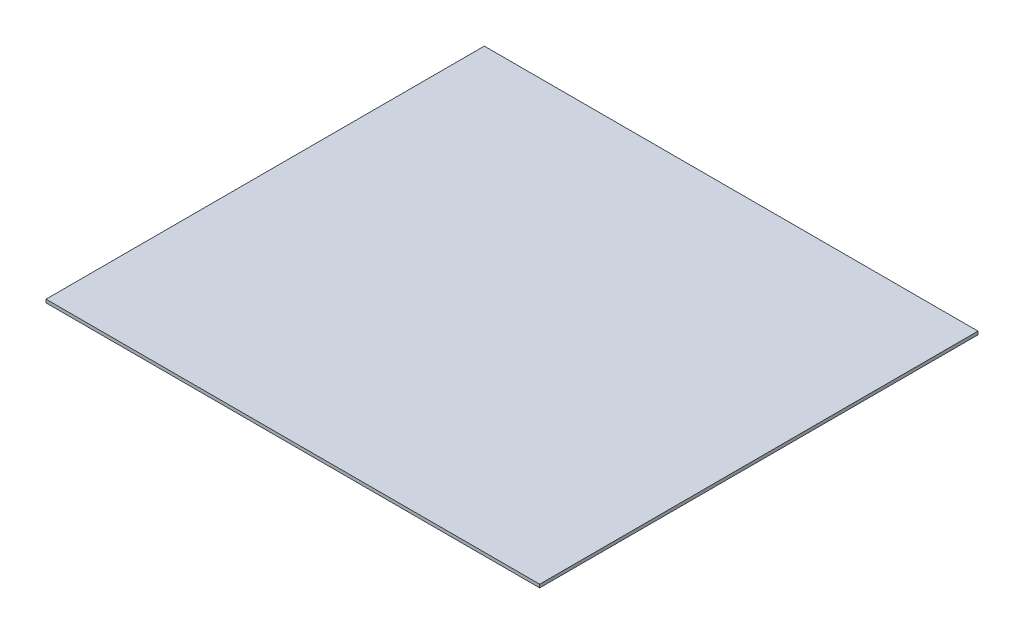
ISO-10303-21;
HEADER;
FILE_DESCRIPTION(('STEP AP214'),'2;1');
FILE_NAME('part.step','',(''),(''),'','','');
FILE_SCHEMA(('AUTOMOTIVE_DESIGN { 1 0 10303 214 1 1 1 1 }'));
ENDSEC;
DATA;
#1=APPLICATION_CONTEXT('core data for automotive mechanical design processes');
#2=APPLICATION_PROTOCOL_DEFINITION('international standard','automotive_design',2000,#1);
#3=PRODUCT_CONTEXT('',#1,'mechanical');
#4=PRODUCT('Part','Part','',(#3));
#5=PRODUCT_RELATED_PRODUCT_CATEGORY('part','',(#4));
#6=PRODUCT_DEFINITION_FORMATION('','',#4);
#7=PRODUCT_DEFINITION_CONTEXT('part definition',#1,'design');
#8=PRODUCT_DEFINITION('design','',#6,#7);
#9=PRODUCT_DEFINITION_SHAPE('','',#8);
#10=(LENGTH_UNIT() NAMED_UNIT(*) SI_UNIT(.MILLI.,.METRE.));
#11=(NAMED_UNIT(*) PLANE_ANGLE_UNIT() SI_UNIT($,.RADIAN.));
#12=(NAMED_UNIT(*) SI_UNIT($,.STERADIAN.) SOLID_ANGLE_UNIT());
#13=UNCERTAINTY_MEASURE_WITH_UNIT(LENGTH_MEASURE(1.E-05),#10,'distance_accuracy_value','');
#14=(GEOMETRIC_REPRESENTATION_CONTEXT(3) GLOBAL_UNCERTAINTY_ASSIGNED_CONTEXT((#13)) GLOBAL_UNIT_ASSIGNED_CONTEXT((#10,
#11,#12)) REPRESENTATION_CONTEXT('',''));
#15=CARTESIAN_POINT('',(0.,0.,0.));
#16=DIRECTION('',(0.,0.,1.));
#17=DIRECTION('',(1.,0.,0.));
#18=AXIS2_PLACEMENT_3D('',#15,#16,#17);
#19=CARTESIAN_POINT('',(-230.884572681199,0.,-410.));
#20=DIRECTION('',(-1.,0.,0.));
#21=DIRECTION('',(0.,-1.,0.));
#22=AXIS2_PLACEMENT_3D('',#19,#20,#21);
#23=PLANE('',#22);
#24=DIRECTION('',(0.,-1.,0.));
#25=VECTOR('',#24,1.);
#26=CARTESIAN_POINT('',(-230.884572681199,0.,0.));
#27=LINE('',#26,#25);
#28=CARTESIAN_POINT('',(-230.884572681199,3.,0.));
#29=VERTEX_POINT('',#28);
#30=CARTESIAN_POINT('',(-230.884572681199,0.,0.));
#31=VERTEX_POINT('',#30);
#32=EDGE_CURVE('E99',#29,#31,#27,.T.);
#33=ORIENTED_EDGE('',*,*,#32,.F.);
#34=DIRECTION('',(0.,0.,1.));
#35=VECTOR('',#34,1.);
#36=CARTESIAN_POINT('',(-230.884572681199,3.,-410.));
#37=LINE('',#36,#35);
#38=CARTESIAN_POINT('',(-230.884572681199,3.,-410.));
#39=VERTEX_POINT('',#38);
#40=EDGE_CURVE('E11',#39,#29,#37,.T.);
#41=ORIENTED_EDGE('',*,*,#40,.F.);
#42=DIRECTION('',(0.,-1.,0.));
#43=VECTOR('',#42,1.);
#44=CARTESIAN_POINT('',(-230.884572681199,0.,-410.));
#45=LINE('',#44,#43);
#46=CARTESIAN_POINT('',(-230.884572681199,0.,-410.));
#47=VERTEX_POINT('',#46);
#48=EDGE_CURVE('E93',#39,#47,#45,.T.);
#49=ORIENTED_EDGE('',*,*,#48,.T.);
#50=DIRECTION('',(0.,0.,1.));
#51=VECTOR('',#50,1.);
#52=CARTESIAN_POINT('',(-230.884572681199,0.,-410.));
#53=LINE('',#52,#51);
#54=EDGE_CURVE('E38',#47,#31,#53,.T.);
#55=ORIENTED_EDGE('',*,*,#54,.T.);
#56=EDGE_LOOP('',(#33,#41,#49,#55));
#57=FACE_BOUND('',#56,.T.);
#58=ADVANCED_FACE('F35',(#57),#23,.T.);
#59=CARTESIAN_POINT('',(-230.884572681199,3.,-410.));
#60=DIRECTION('',(0.,1.,0.));
#61=DIRECTION('',(0.,0.,1.));
#62=AXIS2_PLACEMENT_3D('',#59,#60,#61);
#63=PLANE('',#62);
#64=DIRECTION('',(-1.,0.,0.));
#65=VECTOR('',#64,1.);
#66=CARTESIAN_POINT('',(-230.884572681199,3.,0.));
#67=LINE('',#66,#65);
#68=CARTESIAN_POINT('',(230.884572681199,3.,0.));
#69=VERTEX_POINT('',#68);
#70=EDGE_CURVE('E95',#69,#29,#67,.T.);
#71=ORIENTED_EDGE('',*,*,#70,.F.);
#72=DIRECTION('',(0.,0.,1.));
#73=VECTOR('',#72,1.);
#74=CARTESIAN_POINT('',(230.884572681199,3.,-410.));
#75=LINE('',#74,#73);
#76=CARTESIAN_POINT('',(230.884572681199,3.,-410.));
#77=VERTEX_POINT('',#76);
#78=EDGE_CURVE('E44',#77,#69,#75,.T.);
#79=ORIENTED_EDGE('',*,*,#78,.F.);
#80=DIRECTION('',(-1.,0.,0.));
#81=VECTOR('',#80,1.);
#82=CARTESIAN_POINT('',(-230.884572681199,3.,-410.));
#83=LINE('',#82,#81);
#84=EDGE_CURVE('E90',#77,#39,#83,.T.);
#85=ORIENTED_EDGE('',*,*,#84,.T.);
#86=ORIENTED_EDGE('',*,*,#40,.T.);
#87=EDGE_LOOP('',(#71,#79,#85,#86));
#88=FACE_BOUND('',#87,.T.);
#89=ADVANCED_FACE('F109',(#88),#63,.T.);
#90=CARTESIAN_POINT('',(230.884572681199,3.,-410.));
#91=DIRECTION('',(1.,0.,0.));
#92=DIRECTION('',(0.,1.,0.));
#93=AXIS2_PLACEMENT_3D('',#90,#91,#92);
#94=PLANE('',#93);
#95=DIRECTION('',(0.,1.,0.));
#96=VECTOR('',#95,1.);
#97=CARTESIAN_POINT('',(230.884572681199,3.,0.));
#98=LINE('',#97,#96);
#99=CARTESIAN_POINT('',(230.884572681199,0.,0.));
#100=VERTEX_POINT('',#99);
#101=EDGE_CURVE('E85',#100,#69,#98,.T.);
#102=ORIENTED_EDGE('',*,*,#101,.F.);
#103=DIRECTION('',(0.,0.,1.));
#104=VECTOR('',#103,1.);
#105=CARTESIAN_POINT('',(230.884572681199,0.,-410.));
#106=LINE('',#105,#104);
#107=CARTESIAN_POINT('',(230.884572681199,0.,-410.));
#108=VERTEX_POINT('',#107);
#109=EDGE_CURVE('E80',#108,#100,#106,.T.);
#110=ORIENTED_EDGE('',*,*,#109,.F.);
#111=DIRECTION('',(0.,1.,0.));
#112=VECTOR('',#111,1.);
#113=CARTESIAN_POINT('',(230.884572681199,3.,-410.));
#114=LINE('',#113,#112);
#115=EDGE_CURVE('E83',#108,#77,#114,.T.);
#116=ORIENTED_EDGE('',*,*,#115,.T.);
#117=ORIENTED_EDGE('',*,*,#78,.T.);
#118=EDGE_LOOP('',(#102,#110,#116,#117));
#119=FACE_BOUND('',#118,.T.);
#120=ADVANCED_FACE('F82',(#119),#94,.T.);
#121=CARTESIAN_POINT('',(230.884572681199,0.,-410.));
#122=DIRECTION('',(0.,-1.,0.));
#123=DIRECTION('',(0.,0.,-1.));
#124=AXIS2_PLACEMENT_3D('',#121,#122,#123);
#125=PLANE('',#124);
#126=DIRECTION('',(1.,0.,0.));
#127=VECTOR('',#126,1.);
#128=CARTESIAN_POINT('',(230.884572681199,0.,0.));
#129=LINE('',#128,#127);
#130=EDGE_CURVE('E102',#31,#100,#129,.T.);
#131=ORIENTED_EDGE('',*,*,#130,.F.);
#132=ORIENTED_EDGE('',*,*,#54,.F.);
#133=DIRECTION('',(1.,0.,0.));
#134=VECTOR('',#133,1.);
#135=CARTESIAN_POINT('',(230.884572681199,0.,-410.));
#136=LINE('',#135,#134);
#137=EDGE_CURVE('E89',#47,#108,#136,.T.);
#138=ORIENTED_EDGE('',*,*,#137,.T.);
#139=ORIENTED_EDGE('',*,*,#109,.T.);
#140=EDGE_LOOP('',(#131,#132,#138,#139));
#141=FACE_BOUND('',#140,.T.);
#142=ADVANCED_FACE('F92',(#141),#125,.T.);
#143=CARTESIAN_POINT('',(-230.884572681199,3.,-410.));
#144=DIRECTION('',(0.,0.,-1.));
#145=DIRECTION('',(-1.,0.,0.));
#146=AXIS2_PLACEMENT_3D('',#143,#144,#145);
#147=PLANE('',#146);
#148=ORIENTED_EDGE('',*,*,#48,.F.);
#149=ORIENTED_EDGE('',*,*,#84,.F.);
#150=ORIENTED_EDGE('',*,*,#115,.F.);
#151=ORIENTED_EDGE('',*,*,#137,.F.);
#152=EDGE_LOOP('',(#148,#149,#150,#151));
#153=FACE_BOUND('',#152,.T.);
#154=ADVANCED_FACE('F88',(#153),#147,.T.);
#155=CARTESIAN_POINT('',(-230.884572681199,3.,0.));
#156=DIRECTION('',(0.,0.,-1.));
#157=DIRECTION('',(-1.,0.,0.));
#158=AXIS2_PLACEMENT_3D('',#155,#156,#157);
#159=PLANE('',#158);
#160=ORIENTED_EDGE('',*,*,#32,.T.);
#161=ORIENTED_EDGE('',*,*,#130,.T.);
#162=ORIENTED_EDGE('',*,*,#101,.T.);
#163=ORIENTED_EDGE('',*,*,#70,.T.);
#164=EDGE_LOOP('',(#160,#161,#162,#163));
#165=FACE_BOUND('',#164,.T.);
#166=ADVANCED_FACE('F108',(#165),#159,.F.);
#167=CLOSED_SHELL('',(#58,#89,#120,#142,#154,#166));
#168=MANIFOLD_SOLID_BREP('B2',#167);
#169=ADVANCED_BREP_SHAPE_REPRESENTATION('',(#18,#168),#14);
#170=SHAPE_DEFINITION_REPRESENTATION(#9,#169);
ENDSEC;
END-ISO-10303-21;
